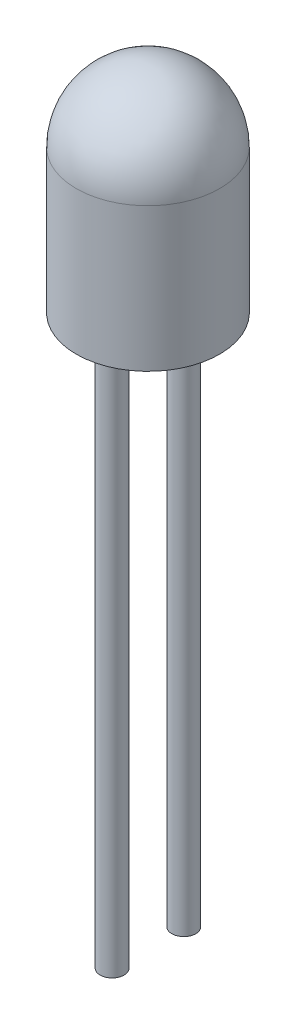
ISO-10303-21;
HEADER;
FILE_DESCRIPTION(('STEP AP214'),'2;1');
FILE_NAME('part.step','',(''),(''),'','','');
FILE_SCHEMA(('AUTOMOTIVE_DESIGN { 1 0 10303 214 1 1 1 1 }'));
ENDSEC;
DATA;
#1=APPLICATION_CONTEXT('core data for automotive mechanical design processes');
#2=APPLICATION_PROTOCOL_DEFINITION('international standard','automotive_design',2000,#1);
#3=PRODUCT_CONTEXT('',#1,'mechanical');
#4=PRODUCT('Part','Part','',(#3));
#5=PRODUCT_RELATED_PRODUCT_CATEGORY('part','',(#4));
#6=PRODUCT_DEFINITION_FORMATION('','',#4);
#7=PRODUCT_DEFINITION_CONTEXT('part definition',#1,'design');
#8=PRODUCT_DEFINITION('design','',#6,#7);
#9=PRODUCT_DEFINITION_SHAPE('','',#8);
#10=(LENGTH_UNIT() NAMED_UNIT(*) SI_UNIT(.MILLI.,.METRE.));
#11=(NAMED_UNIT(*) PLANE_ANGLE_UNIT() SI_UNIT($,.RADIAN.));
#12=(NAMED_UNIT(*) SI_UNIT($,.STERADIAN.) SOLID_ANGLE_UNIT());
#13=UNCERTAINTY_MEASURE_WITH_UNIT(LENGTH_MEASURE(1.E-05),#10,'distance_accuracy_value','');
#14=(GEOMETRIC_REPRESENTATION_CONTEXT(3) GLOBAL_UNCERTAINTY_ASSIGNED_CONTEXT((#13)) GLOBAL_UNIT_ASSIGNED_CONTEXT((#10,
#11,#12)) REPRESENTATION_CONTEXT('',''));
#15=CARTESIAN_POINT('',(0.,0.,0.));
#16=DIRECTION('',(0.,0.,1.));
#17=DIRECTION('',(1.,0.,0.));
#18=AXIS2_PLACEMENT_3D('',#15,#16,#17);
#19=CARTESIAN_POINT('',(0.,0.,0.));
#20=DIRECTION('',(0.,1.,0.));
#21=DIRECTION('',(0.,0.,1.));
#22=AXIS2_PLACEMENT_3D('',#19,#20,#21);
#23=PLANE('',#22);
#24=CARTESIAN_POINT('',(0.,0.,0.75));
#25=DIRECTION('',(0.,1.,0.));
#26=DIRECTION('',(0.,0.,1.));
#27=AXIS2_PLACEMENT_3D('',#24,#25,#26);
#28=CIRCLE('',#27,0.25);
#29=CARTESIAN_POINT('',(0.,0.,1.));
#30=VERTEX_POINT('',#29);
#31=EDGE_CURVE('E41',#30,#30,#28,.F.);
#32=ORIENTED_EDGE('',*,*,#31,.F.);
#33=EDGE_LOOP('',(#32));
#34=FACE_BOUND('',#33,.T.);
#35=CARTESIAN_POINT('',(0.,0.,0.));
#36=DIRECTION('',(0.,1.,0.));
#37=DIRECTION('',(0.,0.,1.));
#38=AXIS2_PLACEMENT_3D('',#35,#36,#37);
#39=CIRCLE('',#38,1.5);
#40=CARTESIAN_POINT('',(0.,0.,1.5));
#41=VERTEX_POINT('',#40);
#42=EDGE_CURVE('E49',#41,#41,#39,.T.);
#43=ORIENTED_EDGE('',*,*,#42,.F.);
#44=EDGE_LOOP('',(#43));
#45=FACE_BOUND('',#44,.T.);
#46=CARTESIAN_POINT('',(0.,0.,-0.75));
#47=DIRECTION('',(0.,1.,0.));
#48=DIRECTION('',(0.,0.,1.));
#49=AXIS2_PLACEMENT_3D('',#46,#47,#48);
#50=CIRCLE('',#49,0.25);
#51=CARTESIAN_POINT('',(0.,0.,-0.5));
#52=VERTEX_POINT('',#51);
#53=EDGE_CURVE('E10',#52,#52,#50,.F.);
#54=ORIENTED_EDGE('',*,*,#53,.F.);
#55=EDGE_LOOP('',(#54));
#56=FACE_BOUND('',#55,.T.);
#57=ADVANCED_FACE('F34',(#34,#45,#56),#23,.F.);
#58=CARTESIAN_POINT('',(0.,3.,0.));
#59=DIRECTION('',(0.,-1.,0.));
#60=DIRECTION('',(0.,0.,-1.));
#61=AXIS2_PLACEMENT_3D('',#58,#59,#60);
#62=CYLINDRICAL_SURFACE('',#61,1.5);
#63=CARTESIAN_POINT('',(0.,3.,0.));
#64=DIRECTION('',(0.,1.,0.));
#65=DIRECTION('',(0.,0.,1.));
#66=AXIS2_PLACEMENT_3D('',#63,#64,#65);
#67=CIRCLE('',#66,1.5);
#68=CARTESIAN_POINT('',(0.,3.,1.5));
#69=VERTEX_POINT('',#68);
#70=EDGE_CURVE('E45',#69,#69,#67,.T.);
#71=ORIENTED_EDGE('',*,*,#70,.F.);
#72=EDGE_LOOP('',(#71));
#73=FACE_BOUND('',#72,.T.);
#74=ORIENTED_EDGE('',*,*,#42,.T.);
#75=EDGE_LOOP('',(#74));
#76=FACE_BOUND('',#75,.T.);
#77=ADVANCED_FACE('F76',(#73,#76),#62,.T.);
#78=CARTESIAN_POINT('',(0.,3.,0.));
#79=DIRECTION('',(0.,0.,1.));
#80=DIRECTION('',(1.,0.,0.));
#81=AXIS2_PLACEMENT_3D('',#78,#79,#80);
#82=SPHERICAL_SURFACE('',#81,1.5);
#83=CARTESIAN_POINT('',(0.,3.,0.));
#84=DIRECTION('',(0.,1.,0.));
#85=DIRECTION('',(0.,0.,1.));
#86=AXIS2_PLACEMENT_3D('',#83,#84,#85);
#87=SPHERICAL_SURFACE('',#86,1.5);
#88=ORIENTED_EDGE('',*,*,#70,.T.);
#89=EDGE_LOOP('',(#88));
#90=FACE_BOUND('',#89,.T.);
#91=ADVANCED_FACE('F36',(#90),#87,.T.);
#92=CARTESIAN_POINT('',(0.,-11.5,0.75));
#93=DIRECTION('',(0.,1.,0.));
#94=DIRECTION('',(0.,0.,1.));
#95=AXIS2_PLACEMENT_3D('',#92,#93,#94);
#96=CYLINDRICAL_SURFACE('',#95,0.25);
#97=CARTESIAN_POINT('',(0.,-11.5,0.75));
#98=DIRECTION('',(0.,-1.,0.));
#99=DIRECTION('',(0.,0.,-1.));
#100=AXIS2_PLACEMENT_3D('',#97,#98,#99);
#101=CIRCLE('',#100,0.25);
#102=CARTESIAN_POINT('',(0.,-11.5,0.5));
#103=VERTEX_POINT('',#102);
#104=EDGE_CURVE('E54',#103,#103,#101,.T.);
#105=ORIENTED_EDGE('',*,*,#104,.F.);
#106=EDGE_LOOP('',(#105));
#107=FACE_BOUND('',#106,.T.);
#108=ORIENTED_EDGE('',*,*,#31,.T.);
#109=EDGE_LOOP('',(#108));
#110=FACE_BOUND('',#109,.T.);
#111=ADVANCED_FACE('F72',(#107,#110),#96,.T.);
#112=CARTESIAN_POINT('',(0.,-11.5,0.75));
#113=DIRECTION('',(0.,-1.,0.));
#114=DIRECTION('',(0.,0.,-1.));
#115=AXIS2_PLACEMENT_3D('',#112,#113,#114);
#116=PLANE('',#115);
#117=ORIENTED_EDGE('',*,*,#104,.T.);
#118=EDGE_LOOP('',(#117));
#119=FACE_BOUND('',#118,.T.);
#120=ADVANCED_FACE('F65',(#119),#116,.T.);
#121=CARTESIAN_POINT('',(0.,-11.5,-0.75));
#122=DIRECTION('',(0.,1.,0.));
#123=DIRECTION('',(0.,0.,1.));
#124=AXIS2_PLACEMENT_3D('',#121,#122,#123);
#125=CYLINDRICAL_SURFACE('',#124,0.25);
#126=CARTESIAN_POINT('',(0.,-11.5,-0.75));
#127=DIRECTION('',(0.,-1.,0.));
#128=DIRECTION('',(0.,0.,-1.));
#129=AXIS2_PLACEMENT_3D('',#126,#127,#128);
#130=CIRCLE('',#129,0.25);
#131=CARTESIAN_POINT('',(0.,-11.5,-1.));
#132=VERTEX_POINT('',#131);
#133=EDGE_CURVE('E57',#132,#132,#130,.T.);
#134=ORIENTED_EDGE('',*,*,#133,.F.);
#135=EDGE_LOOP('',(#134));
#136=FACE_BOUND('',#135,.T.);
#137=ORIENTED_EDGE('',*,*,#53,.T.);
#138=EDGE_LOOP('',(#137));
#139=FACE_BOUND('',#138,.T.);
#140=ADVANCED_FACE('F63',(#136,#139),#125,.T.);
#141=CARTESIAN_POINT('',(0.,-11.5,-0.75));
#142=DIRECTION('',(0.,-1.,0.));
#143=DIRECTION('',(0.,0.,-1.));
#144=AXIS2_PLACEMENT_3D('',#141,#142,#143);
#145=PLANE('',#144);
#146=ORIENTED_EDGE('',*,*,#133,.T.);
#147=EDGE_LOOP('',(#146));
#148=FACE_BOUND('',#147,.T.);
#149=ADVANCED_FACE('F61',(#148),#145,.T.);
#150=CLOSED_SHELL('',(#57,#77,#91,#111,#120,#140,#149));
#151=MANIFOLD_SOLID_BREP('B2',#150);
#152=ADVANCED_BREP_SHAPE_REPRESENTATION('',(#18,#151),#14);
#153=SHAPE_DEFINITION_REPRESENTATION(#9,#152);
ENDSEC;
END-ISO-10303-21;
